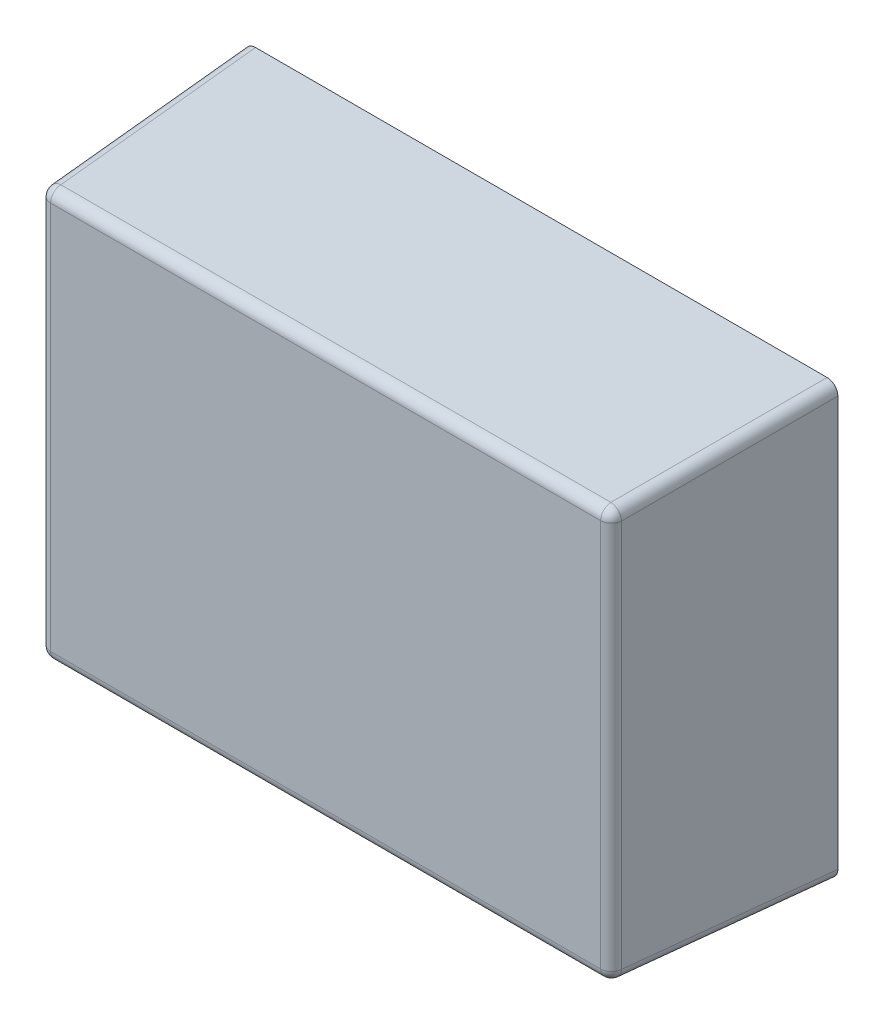
ISO-10303-21;
HEADER;
FILE_DESCRIPTION(('STEP AP214'),'2;1');
FILE_NAME('part.step','',(''),(''),'','','');
FILE_SCHEMA(('AUTOMOTIVE_DESIGN { 1 0 10303 214 1 1 1 1 }'));
ENDSEC;
DATA;
#1=APPLICATION_CONTEXT('core data for automotive mechanical design processes');
#2=APPLICATION_PROTOCOL_DEFINITION('international standard','automotive_design',2000,#1);
#3=PRODUCT_CONTEXT('',#1,'mechanical');
#4=PRODUCT('Part','Part','',(#3));
#5=PRODUCT_RELATED_PRODUCT_CATEGORY('part','',(#4));
#6=PRODUCT_DEFINITION_FORMATION('','',#4);
#7=PRODUCT_DEFINITION_CONTEXT('part definition',#1,'design');
#8=PRODUCT_DEFINITION('design','',#6,#7);
#9=PRODUCT_DEFINITION_SHAPE('','',#8);
#10=(LENGTH_UNIT() NAMED_UNIT(*) SI_UNIT(.MILLI.,.METRE.));
#11=(NAMED_UNIT(*) PLANE_ANGLE_UNIT() SI_UNIT($,.RADIAN.));
#12=(NAMED_UNIT(*) SI_UNIT($,.STERADIAN.) SOLID_ANGLE_UNIT());
#13=UNCERTAINTY_MEASURE_WITH_UNIT(LENGTH_MEASURE(1.E-05),#10,'distance_accuracy_value','');
#14=(GEOMETRIC_REPRESENTATION_CONTEXT(3) GLOBAL_UNCERTAINTY_ASSIGNED_CONTEXT((#13)) GLOBAL_UNIT_ASSIGNED_CONTEXT((#10,
#11,#12)) REPRESENTATION_CONTEXT('',''));
#15=CARTESIAN_POINT('',(0.,0.,0.));
#16=DIRECTION('',(0.,0.,1.));
#17=DIRECTION('',(1.,0.,0.));
#18=AXIS2_PLACEMENT_3D('',#15,#16,#17);
#19=CARTESIAN_POINT('',(-0.55,-0.4,0.4));
#20=DIRECTION('',(0.,0.,1.));
#21=DIRECTION('',(1.,0.,0.));
#22=AXIS2_PLACEMENT_3D('',#19,#20,#21);
#23=PLANE('',#22);
#24=DIRECTION('',(0.,1.,0.));
#25=VECTOR('',#24,1.);
#26=CARTESIAN_POINT('',(-0.510057596952,-0.4,0.4));
#27=LINE('',#26,#25);
#28=CARTESIAN_POINT('',(-0.510057596952,-0.360057596952,0.4));
#29=VERTEX_POINT('',#28);
#30=CARTESIAN_POINT('',(-0.510057596952,0.360057596952,0.4));
#31=VERTEX_POINT('',#30);
#32=EDGE_CURVE('E99',#29,#31,#27,.T.);
#33=ORIENTED_EDGE('',*,*,#32,.F.);
#34=DIRECTION('',(-1.,0.,0.));
#35=VECTOR('',#34,1.);
#36=CARTESIAN_POINT('',(-0.55,-0.360057596952,0.4));
#37=LINE('',#36,#35);
#38=CARTESIAN_POINT('',(0.510057596952,-0.360057596952,0.4));
#39=VERTEX_POINT('',#38);
#40=EDGE_CURVE('E101',#39,#29,#37,.T.);
#41=ORIENTED_EDGE('',*,*,#40,.F.);
#42=DIRECTION('',(0.,-1.,0.));
#43=VECTOR('',#42,1.);
#44=CARTESIAN_POINT('',(0.510057596952,-0.4,0.4));
#45=LINE('',#44,#43);
#46=CARTESIAN_POINT('',(0.510057596952,0.360057596952,0.4));
#47=VERTEX_POINT('',#46);
#48=EDGE_CURVE('E93',#47,#39,#45,.T.);
#49=ORIENTED_EDGE('',*,*,#48,.F.);
#50=DIRECTION('',(1.,0.,0.));
#51=VECTOR('',#50,1.);
#52=CARTESIAN_POINT('',(-0.55,0.360057596952,0.4));
#53=LINE('',#52,#51);
#54=EDGE_CURVE('E103',#31,#47,#53,.T.);
#55=ORIENTED_EDGE('',*,*,#54,.F.);
#56=EDGE_LOOP('',(#33,#41,#49,#55));
#57=FACE_BOUND('',#56,.T.);
#58=ADVANCED_FACE('F17',(#57),#23,.T.);
#59=CARTESIAN_POINT('',(-0.510057596952,0.360057596952,0.38));
#60=DIRECTION('',(1.,0.,0.));
#61=DIRECTION('',(0.,1.,0.));
#62=AXIS2_PLACEMENT_3D('',#59,#60,#61);
#63=SPHERICAL_SURFACE('',#62,0.02);
#64=CARTESIAN_POINT('',(-0.510057596952,0.360057596952,0.38));
#65=DIRECTION('',(0.,1.,0.));
#66=DIRECTION('',(0.,0.,1.));
#67=AXIS2_PLACEMENT_3D('',#64,#65,#66);
#68=CIRCLE('',#67,0.02);
#69=CARTESIAN_POINT('',(-0.530030187647334,0.360057596952,0.381046719124965));
#70=VERTEX_POINT('',#69);
#71=EDGE_CURVE('E84',#31,#70,#68,.F.);
#72=ORIENTED_EDGE('',*,*,#71,.F.);
#73=CARTESIAN_POINT('',(-0.510057596952,0.360057596952,0.38));
#74=DIRECTION('',(1.,0.,0.));
#75=DIRECTION('',(0.,1.,0.));
#76=AXIS2_PLACEMENT_3D('',#73,#74,#75);
#77=CIRCLE('',#76,0.02);
#78=CARTESIAN_POINT('',(-0.510057596952,0.380030187647405,0.381046719124969));
#79=VERTEX_POINT('',#78);
#80=EDGE_CURVE('E153',#79,#31,#77,.T.);
#81=ORIENTED_EDGE('',*,*,#80,.F.);
#82=CARTESIAN_POINT('',(-0.510057596952631,0.360057596952631,0.38000000000016));
#83=DIRECTION('',(0.0522644276887224,-0.0522644276887224,0.997264688634236));
#84=DIRECTION('',(0.998629534754573,0.,-0.0523359562429523));
#85=AXIS2_PLACEMENT_3D('',#82,#83,#84);
#86=CIRCLE('',#85,0.02);
#87=EDGE_CURVE('E20',#70,#79,#86,.F.);
#88=ORIENTED_EDGE('',*,*,#87,.F.);
#89=EDGE_LOOP('',(#72,#81,#88));
#90=FACE_BOUND('',#89,.T.);
#91=ADVANCED_FACE('F142',(#90),#63,.T.);
#92=CARTESIAN_POINT('',(-0.510057596952,-0.4,0.38));
#93=DIRECTION('',(0.,1.,0.));
#94=DIRECTION('',(0.,0.,1.));
#95=AXIS2_PLACEMENT_3D('',#92,#93,#94);
#96=CYLINDRICAL_SURFACE('',#95,0.02);
#97=ORIENTED_EDGE('',*,*,#71,.T.);
#98=DIRECTION('',(0.,1.,0.));
#99=VECTOR('',#98,1.);
#100=CARTESIAN_POINT('',(-0.530030187647581,0.,0.381046719124978));
#101=LINE('',#100,#99);
#102=CARTESIAN_POINT('',(-0.530030187647527,-0.360057596952,0.381046719124975));
#103=VERTEX_POINT('',#102);
#104=EDGE_CURVE('E108',#103,#70,#101,.T.);
#105=ORIENTED_EDGE('',*,*,#104,.F.);
#106=CARTESIAN_POINT('',(-0.510057596952,-0.360057596952,0.38));
#107=DIRECTION('',(0.,-1.,0.));
#108=DIRECTION('',(1.,0.,0.));
#109=AXIS2_PLACEMENT_3D('',#106,#107,#108);
#110=CIRCLE('',#109,0.02);
#111=EDGE_CURVE('E106',#29,#103,#110,.T.);
#112=ORIENTED_EDGE('',*,*,#111,.F.);
#113=ORIENTED_EDGE('',*,*,#32,.T.);
#114=EDGE_LOOP('',(#97,#105,#112,#113));
#115=FACE_BOUND('',#114,.T.);
#116=ADVANCED_FACE('F107',(#115),#96,.T.);
#117=CARTESIAN_POINT('',(-0.510057596952,-0.360057596952,0.38));
#118=DIRECTION('',(1.,0.,0.));
#119=DIRECTION('',(0.,1.,0.));
#120=AXIS2_PLACEMENT_3D('',#117,#118,#119);
#121=SPHERICAL_SURFACE('',#120,0.02);
#122=CARTESIAN_POINT('',(-0.510057596952874,-0.360057596952874,0.380000000000185));
#123=DIRECTION('',(0.0522644276887224,0.0522644276887224,0.997264688634236));
#124=DIRECTION('',(0.998629534754573,0.,-0.0523359562429523));
#125=AXIS2_PLACEMENT_3D('',#122,#123,#124);
#126=CIRCLE('',#125,0.02);
#127=CARTESIAN_POINT('',(-0.510057596952001,-0.380030187647334,0.381046719124965));
#128=VERTEX_POINT('',#127);
#129=EDGE_CURVE('E123',#128,#103,#126,.F.);
#130=ORIENTED_EDGE('',*,*,#129,.F.);
#131=CARTESIAN_POINT('',(-0.510057596952,-0.360057596952,0.38));
#132=DIRECTION('',(-1.,0.,0.));
#133=DIRECTION('',(0.,-1.,0.));
#134=AXIS2_PLACEMENT_3D('',#131,#132,#133);
#135=CIRCLE('',#134,0.02);
#136=EDGE_CURVE('E114',#29,#128,#135,.F.);
#137=ORIENTED_EDGE('',*,*,#136,.F.);
#138=ORIENTED_EDGE('',*,*,#111,.T.);
#139=EDGE_LOOP('',(#130,#137,#138));
#140=FACE_BOUND('',#139,.T.);
#141=ADVANCED_FACE('F122',(#140),#121,.T.);
#142=CARTESIAN_POINT('',(-0.55,-0.360057596952,0.38));
#143=DIRECTION('',(-1.,0.,0.));
#144=DIRECTION('',(0.,-1.,0.));
#145=AXIS2_PLACEMENT_3D('',#142,#143,#144);
#146=CYLINDRICAL_SURFACE('',#145,0.02);
#147=CARTESIAN_POINT('',(0.510057596952,-0.360057596952,0.38));
#148=DIRECTION('',(1.,0.,0.));
#149=DIRECTION('',(0.,1.,0.));
#150=AXIS2_PLACEMENT_3D('',#147,#148,#149);
#151=CIRCLE('',#150,0.02);
#152=CARTESIAN_POINT('',(0.510057596952,-0.380030187647405,0.381046719124969));
#153=VERTEX_POINT('',#152);
#154=EDGE_CURVE('E120',#39,#153,#151,.T.);
#155=ORIENTED_EDGE('',*,*,#154,.F.);
#156=ORIENTED_EDGE('',*,*,#40,.T.);
#157=ORIENTED_EDGE('',*,*,#136,.T.);
#158=DIRECTION('',(1.,0.,0.));
#159=VECTOR('',#158,1.);
#160=CARTESIAN_POINT('',(0.,-0.380030187647581,0.381046719124978));
#161=LINE('',#160,#159);
#162=EDGE_CURVE('E195',#153,#128,#161,.F.);
#163=ORIENTED_EDGE('',*,*,#162,.F.);
#164=EDGE_LOOP('',(#155,#156,#157,#163));
#165=FACE_BOUND('',#164,.T.);
#166=ADVANCED_FACE('F117',(#165),#146,.T.);
#167=CARTESIAN_POINT('',(0.510057596952,-0.360057596952,0.38));
#168=DIRECTION('',(1.,0.,0.));
#169=DIRECTION('',(0.,1.,0.));
#170=AXIS2_PLACEMENT_3D('',#167,#168,#169);
#171=SPHERICAL_SURFACE('',#170,0.02);
#172=CARTESIAN_POINT('',(0.510057596952631,-0.360057596952631,0.380000000000159));
#173=DIRECTION('',(-0.0522644276887224,0.0522644276887224,0.997264688634236));
#174=DIRECTION('',(0.998629534754573,0.,0.0523359562429523));
#175=AXIS2_PLACEMENT_3D('',#172,#173,#174);
#176=CIRCLE('',#175,0.02);
#177=CARTESIAN_POINT('',(0.530030187647334,-0.360057596952001,0.381046719124965));
#178=VERTEX_POINT('',#177);
#179=EDGE_CURVE('E189',#178,#153,#176,.F.);
#180=ORIENTED_EDGE('',*,*,#179,.F.);
#181=CARTESIAN_POINT('',(0.510057596952,-0.360057596952,0.38));
#182=DIRECTION('',(0.,-1.,0.));
#183=DIRECTION('',(1.,0.,0.));
#184=AXIS2_PLACEMENT_3D('',#181,#182,#183);
#185=CIRCLE('',#184,0.02);
#186=EDGE_CURVE('E158',#39,#178,#185,.F.);
#187=ORIENTED_EDGE('',*,*,#186,.F.);
#188=ORIENTED_EDGE('',*,*,#154,.T.);
#189=EDGE_LOOP('',(#180,#187,#188));
#190=FACE_BOUND('',#189,.T.);
#191=ADVANCED_FACE('F226',(#190),#171,.T.);
#192=CARTESIAN_POINT('',(0.510057596952,-0.4,0.38));
#193=DIRECTION('',(0.,-1.,0.));
#194=DIRECTION('',(1.,0.,0.));
#195=AXIS2_PLACEMENT_3D('',#192,#193,#194);
#196=CYLINDRICAL_SURFACE('',#195,0.02);
#197=CARTESIAN_POINT('',(0.510057596952,0.360057596952,0.38));
#198=DIRECTION('',(0.,-1.,0.));
#199=DIRECTION('',(1.,0.,0.));
#200=AXIS2_PLACEMENT_3D('',#197,#198,#199);
#201=CIRCLE('',#200,0.02);
#202=CARTESIAN_POINT('',(0.530030187647526,0.360057596952437,0.381046719124998));
#203=VERTEX_POINT('',#202);
#204=EDGE_CURVE('E157',#47,#203,#201,.F.);
#205=ORIENTED_EDGE('',*,*,#204,.F.);
#206=ORIENTED_EDGE('',*,*,#48,.T.);
#207=ORIENTED_EDGE('',*,*,#186,.T.);
#208=DIRECTION('',(0.,1.,0.));
#209=VECTOR('',#208,1.);
#210=CARTESIAN_POINT('',(0.530030187647581,0.,0.381046719124978));
#211=LINE('',#210,#209);
#212=EDGE_CURVE('E188',#203,#178,#211,.F.);
#213=ORIENTED_EDGE('',*,*,#212,.F.);
#214=EDGE_LOOP('',(#205,#206,#207,#213));
#215=FACE_BOUND('',#214,.T.);
#216=ADVANCED_FACE('F222',(#215),#196,.T.);
#217=CARTESIAN_POINT('',(0.510057596952,0.360057596952,0.38));
#218=DIRECTION('',(1.,0.,0.));
#219=DIRECTION('',(0.,1.,0.));
#220=AXIS2_PLACEMENT_3D('',#217,#218,#219);
#221=SPHERICAL_SURFACE('',#220,0.02);
#222=ORIENTED_EDGE('',*,*,#204,.T.);
#223=CARTESIAN_POINT('',(0.510057596952874,0.360057596952874,0.380000000000185));
#224=DIRECTION('',(-0.0522644276887224,-0.0522644276887224,0.997264688634236));
#225=DIRECTION('',(0.998629534754573,0.,0.0523359562429523));
#226=AXIS2_PLACEMENT_3D('',#223,#224,#225);
#227=CIRCLE('',#226,0.02);
#228=CARTESIAN_POINT('',(0.510057596952002,0.380030187647334,0.381046719124965));
#229=VERTEX_POINT('',#228);
#230=EDGE_CURVE('E183',#229,#203,#227,.F.);
#231=ORIENTED_EDGE('',*,*,#230,.F.);
#232=CARTESIAN_POINT('',(0.510057596952,0.360057596952,0.38));
#233=DIRECTION('',(1.,0.,0.));
#234=DIRECTION('',(0.,1.,0.));
#235=AXIS2_PLACEMENT_3D('',#232,#233,#234);
#236=CIRCLE('',#235,0.02);
#237=EDGE_CURVE('E152',#47,#229,#236,.F.);
#238=ORIENTED_EDGE('',*,*,#237,.F.);
#239=EDGE_LOOP('',(#222,#231,#238));
#240=FACE_BOUND('',#239,.T.);
#241=ADVANCED_FACE('F217',(#240),#221,.T.);
#242=CARTESIAN_POINT('',(-0.55,0.360057596952,0.38));
#243=DIRECTION('',(1.,0.,0.));
#244=DIRECTION('',(0.,1.,0.));
#245=AXIS2_PLACEMENT_3D('',#242,#243,#244);
#246=CYLINDRICAL_SURFACE('',#245,0.02);
#247=ORIENTED_EDGE('',*,*,#237,.T.);
#248=DIRECTION('',(1.,0.,0.));
#249=VECTOR('',#248,1.);
#250=CARTESIAN_POINT('',(0.,0.380030187647581,0.381046719124978));
#251=LINE('',#250,#249);
#252=EDGE_CURVE('E182',#79,#229,#251,.T.);
#253=ORIENTED_EDGE('',*,*,#252,.F.);
#254=ORIENTED_EDGE('',*,*,#80,.T.);
#255=ORIENTED_EDGE('',*,*,#54,.T.);
#256=EDGE_LOOP('',(#247,#253,#254,#255));
#257=FACE_BOUND('',#256,.T.);
#258=ADVANCED_FACE('F221',(#257),#246,.T.);
#259=CARTESIAN_POINT('',(-0.528989337682,0.378989337682,0.0187608674065));
#260=DIRECTION('',(0.0522644276887224,-0.0522644276887224,0.997264688634236));
#261=DIRECTION('',(0.998629534754573,0.,-0.0523359562429523));
#262=AXIS2_PLACEMENT_3D('',#259,#260,#261);
#263=CYLINDRICAL_SURFACE('',#262,0.02);
#264=ORIENTED_EDGE('',*,*,#87,.T.);
#265=DIRECTION('',(0.0522644276902046,-0.0522644276886837,0.997264688634161));
#266=VECTOR('',#265,1.);
#267=CARTESIAN_POINT('',(-0.530027409305,0.4,0.));
#268=LINE('',#267,#266);
#269=CARTESIAN_POINT('',(-0.530027409305033,0.400000000000078,0.));
#270=VERTEX_POINT('',#269);
#271=EDGE_CURVE('E179',#270,#79,#268,.T.);
#272=ORIENTED_EDGE('',*,*,#271,.F.);
#273=CARTESIAN_POINT('',(-0.529972553080198,0.379972553080198,0.));
#274=DIRECTION('',(0.,0.,1.));
#275=DIRECTION('',(0.707106781186548,-0.707106781186548,0.));
#276=AXIS2_PLACEMENT_3D('',#273,#274,#275);
#277=ELLIPSE('',#276,0.0200548562763113,0.02);
#278=CARTESIAN_POINT('',(-0.550000000000078,0.380027409305033,0.));
#279=VERTEX_POINT('',#278);
#280=EDGE_CURVE('E176',#270,#279,#277,.T.);
#281=ORIENTED_EDGE('',*,*,#280,.T.);
#282=DIRECTION('',(-0.0522644276886837,0.0522644276902046,-0.997264688634161));
#283=VECTOR('',#282,1.);
#284=CARTESIAN_POINT('',(-0.530030187647581,0.360057596952,0.381046719124978));
#285=LINE('',#284,#283);
#286=EDGE_CURVE('E133',#70,#279,#285,.T.);
#287=ORIENTED_EDGE('',*,*,#286,.F.);
#288=EDGE_LOOP('',(#264,#272,#281,#287));
#289=FACE_BOUND('',#288,.T.);
#290=ADVANCED_FACE('F277',(#289),#263,.T.);
#291=CARTESIAN_POINT('',(-0.55,0.,0.));
#292=DIRECTION('',(-0.998629534754575,0.,0.0523359562429177));
#293=DIRECTION('',(0.0523359562429177,0.,0.998629534754575));
#294=AXIS2_PLACEMENT_3D('',#291,#292,#293);
#295=PLANE('',#294);
#296=DIRECTION('',(0.,1.,0.));
#297=VECTOR('',#296,1.);
#298=CARTESIAN_POINT('',(-0.55,-0.4,0.));
#299=LINE('',#298,#297);
#300=CARTESIAN_POINT('',(-0.5500000000003,-0.380027409304871,0.));
#301=VERTEX_POINT('',#300);
#302=EDGE_CURVE('E175',#279,#301,#299,.F.);
#303=ORIENTED_EDGE('',*,*,#302,.T.);
#304=DIRECTION('',(0.0522644276887224,0.0522644276887224,0.997264688634236));
#305=VECTOR('',#304,1.);
#306=CARTESIAN_POINT('',(-0.548552192817094,-0.378579602121126,0.0276258067621534));
#307=LINE('',#306,#305);
#308=EDGE_CURVE('E193',#103,#301,#307,.F.);
#309=ORIENTED_EDGE('',*,*,#308,.F.);
#310=ORIENTED_EDGE('',*,*,#104,.T.);
#311=ORIENTED_EDGE('',*,*,#286,.T.);
#312=EDGE_LOOP('',(#303,#309,#310,#311));
#313=FACE_BOUND('',#312,.T.);
#314=ADVANCED_FACE('F281',(#313),#295,.T.);
#315=CARTESIAN_POINT('',(-0.528579602122,-0.378579602122,0.02657908763734));
#316=DIRECTION('',(0.0522644276887224,0.0522644276887224,0.997264688634236));
#317=DIRECTION('',(0.998629534754573,0.,-0.0523359562429523));
#318=AXIS2_PLACEMENT_3D('',#315,#316,#317);
#319=CYLINDRICAL_SURFACE('',#318,0.02);
#320=CARTESIAN_POINT('',(-0.529972553080443,-0.379972553080443,0.));
#321=DIRECTION('',(0.,0.,1.));
#322=DIRECTION('',(0.707106781186548,0.707106781186548,0.));
#323=AXIS2_PLACEMENT_3D('',#320,#321,#322);
#324=ELLIPSE('',#323,0.0200548562763113,0.02);
#325=CARTESIAN_POINT('',(-0.530027409305155,-0.4000000000002,0.));
#326=VERTEX_POINT('',#325);
#327=EDGE_CURVE('E172',#301,#326,#324,.T.);
#328=ORIENTED_EDGE('',*,*,#327,.T.);
#329=DIRECTION('',(-0.0522644276902046,-0.0522644276886837,-0.997264688634161));
#330=VECTOR('',#329,1.);
#331=CARTESIAN_POINT('',(-0.510057596952,-0.380030187647581,0.381046719124978));
#332=LINE('',#331,#330);
#333=EDGE_CURVE('E192',#128,#326,#332,.T.);
#334=ORIENTED_EDGE('',*,*,#333,.F.);
#335=ORIENTED_EDGE('',*,*,#129,.T.);
#336=ORIENTED_EDGE('',*,*,#308,.T.);
#337=EDGE_LOOP('',(#328,#334,#335,#336));
#338=FACE_BOUND('',#337,.T.);
#339=ADVANCED_FACE('F287',(#338),#319,.T.);
#340=CARTESIAN_POINT('',(0.,-0.4,0.));
#341=DIRECTION('',(0.,-0.998629534754575,0.0523359562429177));
#342=DIRECTION('',(0.,-0.0523359562429177,-0.998629534754575));
#343=AXIS2_PLACEMENT_3D('',#340,#341,#342);
#344=PLANE('',#343);
#345=ORIENTED_EDGE('',*,*,#162,.T.);
#346=ORIENTED_EDGE('',*,*,#333,.T.);
#347=DIRECTION('',(1.,0.,0.));
#348=VECTOR('',#347,1.);
#349=CARTESIAN_POINT('',(-0.55,-0.4,0.));
#350=LINE('',#349,#348);
#351=CARTESIAN_POINT('',(0.530027409304749,-0.400000000000118,0.));
#352=VERTEX_POINT('',#351);
#353=EDGE_CURVE('E171',#326,#352,#350,.T.);
#354=ORIENTED_EDGE('',*,*,#353,.T.);
#355=DIRECTION('',(-0.0522644276887224,0.0522644276887224,0.997264688634236));
#356=VECTOR('',#355,1.);
#357=CARTESIAN_POINT('',(0.528989337681369,-0.398961928377093,0.0198075865313261));
#358=LINE('',#357,#356);
#359=EDGE_CURVE('E191',#153,#352,#358,.F.);
#360=ORIENTED_EDGE('',*,*,#359,.F.);
#361=EDGE_LOOP('',(#345,#346,#354,#360));
#362=FACE_BOUND('',#361,.T.);
#363=ADVANCED_FACE('F258',(#362),#344,.T.);
#364=CARTESIAN_POINT('',(0.528989337682,-0.378989337682,0.0187608674065));
#365=DIRECTION('',(-0.0522644276887224,0.0522644276887224,0.997264688634236));
#366=DIRECTION('',(0.998629534754573,0.,0.0523359562429523));
#367=AXIS2_PLACEMENT_3D('',#364,#365,#366);
#368=CYLINDRICAL_SURFACE('',#367,0.02);
#369=ORIENTED_EDGE('',*,*,#179,.T.);
#370=ORIENTED_EDGE('',*,*,#359,.T.);
#371=CARTESIAN_POINT('',(0.529972553080198,-0.379972553080198,0.));
#372=DIRECTION('',(0.,0.,1.));
#373=DIRECTION('',(-0.707106781186548,0.707106781186548,0.));
#374=AXIS2_PLACEMENT_3D('',#371,#372,#373);
#375=ELLIPSE('',#374,0.0200548562763113,0.02);
#376=CARTESIAN_POINT('',(0.550000000000078,-0.380027409305033,0.));
#377=VERTEX_POINT('',#376);
#378=EDGE_CURVE('E168',#352,#377,#375,.T.);
#379=ORIENTED_EDGE('',*,*,#378,.T.);
#380=DIRECTION('',(-0.0522644276886837,0.0522644276902046,0.997264688634161));
#381=VECTOR('',#380,1.);
#382=CARTESIAN_POINT('',(0.55,-0.380027409305,0.));
#383=LINE('',#382,#381);
#384=EDGE_CURVE('E186',#178,#377,#383,.F.);
#385=ORIENTED_EDGE('',*,*,#384,.F.);
#386=EDGE_LOOP('',(#369,#370,#379,#385));
#387=FACE_BOUND('',#386,.T.);
#388=ADVANCED_FACE('F248',(#387),#368,.T.);
#389=CARTESIAN_POINT('',(0.55,0.,0.));
#390=DIRECTION('',(0.998629534754575,0.,0.0523359562429177));
#391=DIRECTION('',(0.0523359562429177,0.,-0.998629534754575));
#392=AXIS2_PLACEMENT_3D('',#389,#390,#391);
#393=PLANE('',#392);
#394=ORIENTED_EDGE('',*,*,#212,.T.);
#395=ORIENTED_EDGE('',*,*,#384,.T.);
#396=DIRECTION('',(0.,1.,0.));
#397=VECTOR('',#396,1.);
#398=CARTESIAN_POINT('',(0.55,-0.4,0.));
#399=LINE('',#398,#397);
#400=CARTESIAN_POINT('',(0.550000000000201,0.380027409305309,0.));
#401=VERTEX_POINT('',#400);
#402=EDGE_CURVE('E167',#377,#401,#399,.T.);
#403=ORIENTED_EDGE('',*,*,#402,.T.);
#404=DIRECTION('',(0.0522644276886877,0.0522644276887225,-0.997264688634238));
#405=VECTOR('',#404,1.);
#406=CARTESIAN_POINT('',(0.530030187647579,0.360057596952874,0.381046719125024));
#407=LINE('',#406,#405);
#408=EDGE_CURVE('E180',#203,#401,#407,.T.);
#409=ORIENTED_EDGE('',*,*,#408,.F.);
#410=EDGE_LOOP('',(#394,#395,#403,#409));
#411=FACE_BOUND('',#410,.T.);
#412=ADVANCED_FACE('F243',(#411),#393,.T.);
#413=CARTESIAN_POINT('',(0.528579602122,0.378579602122,0.02657908763734));
#414=DIRECTION('',(-0.0522644276887224,-0.0522644276887224,0.997264688634236));
#415=DIRECTION('',(0.998629534754573,0.,0.0523359562429523));
#416=AXIS2_PLACEMENT_3D('',#413,#414,#415);
#417=CYLINDRICAL_SURFACE('',#416,0.02);
#418=CARTESIAN_POINT('',(0.529972553080443,0.379972553080443,0.));
#419=DIRECTION('',(0.,0.,1.));
#420=DIRECTION('',(-0.707106781186548,-0.707106781186548,0.));
#421=AXIS2_PLACEMENT_3D('',#418,#419,#420);
#422=ELLIPSE('',#421,0.0200548562763113,0.02);
#423=CARTESIAN_POINT('',(0.530027409305155,0.4000000000002,0.));
#424=VERTEX_POINT('',#423);
#425=EDGE_CURVE('E26',#401,#424,#422,.T.);
#426=ORIENTED_EDGE('',*,*,#425,.T.);
#427=DIRECTION('',(0.0522644276902046,0.0522644276886837,-0.997264688634161));
#428=VECTOR('',#427,1.);
#429=CARTESIAN_POINT('',(0.510057596952,0.380030187647581,0.381046719124978));
#430=LINE('',#429,#428);
#431=EDGE_CURVE('E34',#229,#424,#430,.T.);
#432=ORIENTED_EDGE('',*,*,#431,.F.);
#433=ORIENTED_EDGE('',*,*,#230,.T.);
#434=ORIENTED_EDGE('',*,*,#408,.T.);
#435=EDGE_LOOP('',(#426,#432,#433,#434));
#436=FACE_BOUND('',#435,.T.);
#437=ADVANCED_FACE('F276',(#436),#417,.T.);
#438=CARTESIAN_POINT('',(0.,0.4,0.));
#439=DIRECTION('',(0.,0.998629534754575,0.0523359562429177));
#440=DIRECTION('',(0.,-0.0523359562429177,0.998629534754575));
#441=AXIS2_PLACEMENT_3D('',#438,#439,#440);
#442=PLANE('',#441);
#443=DIRECTION('',(1.,0.,0.));
#444=VECTOR('',#443,1.);
#445=CARTESIAN_POINT('',(-0.55,0.4,0.));
#446=LINE('',#445,#444);
#447=EDGE_CURVE('E11',#424,#270,#446,.F.);
#448=ORIENTED_EDGE('',*,*,#447,.T.);
#449=ORIENTED_EDGE('',*,*,#271,.T.);
#450=ORIENTED_EDGE('',*,*,#252,.T.);
#451=ORIENTED_EDGE('',*,*,#431,.T.);
#452=EDGE_LOOP('',(#448,#449,#450,#451));
#453=FACE_BOUND('',#452,.T.);
#454=ADVANCED_FACE('F268',(#453),#442,.T.);
#455=CARTESIAN_POINT('',(-0.55,-0.4,0.));
#456=DIRECTION('',(0.,0.,1.));
#457=DIRECTION('',(1.,0.,0.));
#458=AXIS2_PLACEMENT_3D('',#455,#456,#457);
#459=PLANE('',#458);
#460=ORIENTED_EDGE('',*,*,#425,.F.);
#461=ORIENTED_EDGE('',*,*,#402,.F.);
#462=ORIENTED_EDGE('',*,*,#378,.F.);
#463=ORIENTED_EDGE('',*,*,#353,.F.);
#464=ORIENTED_EDGE('',*,*,#327,.F.);
#465=ORIENTED_EDGE('',*,*,#302,.F.);
#466=ORIENTED_EDGE('',*,*,#280,.F.);
#467=ORIENTED_EDGE('',*,*,#447,.F.);
#468=EDGE_LOOP('',(#460,#461,#462,#463,#464,#465,#466,#467));
#469=FACE_BOUND('',#468,.T.);
#470=ADVANCED_FACE('F255',(#469),#459,.F.);
#471=CLOSED_SHELL('',(#58,#91,#116,#141,#166,#191,#216,#241,#258,#290,#314,#339,#363,#388,#412,
#437,#454,#470));
#472=MANIFOLD_SOLID_BREP('B1',#471);
#473=ADVANCED_BREP_SHAPE_REPRESENTATION('',(#18,#472),#14);
#474=SHAPE_DEFINITION_REPRESENTATION(#9,#473);
ENDSEC;
END-ISO-10303-21;
